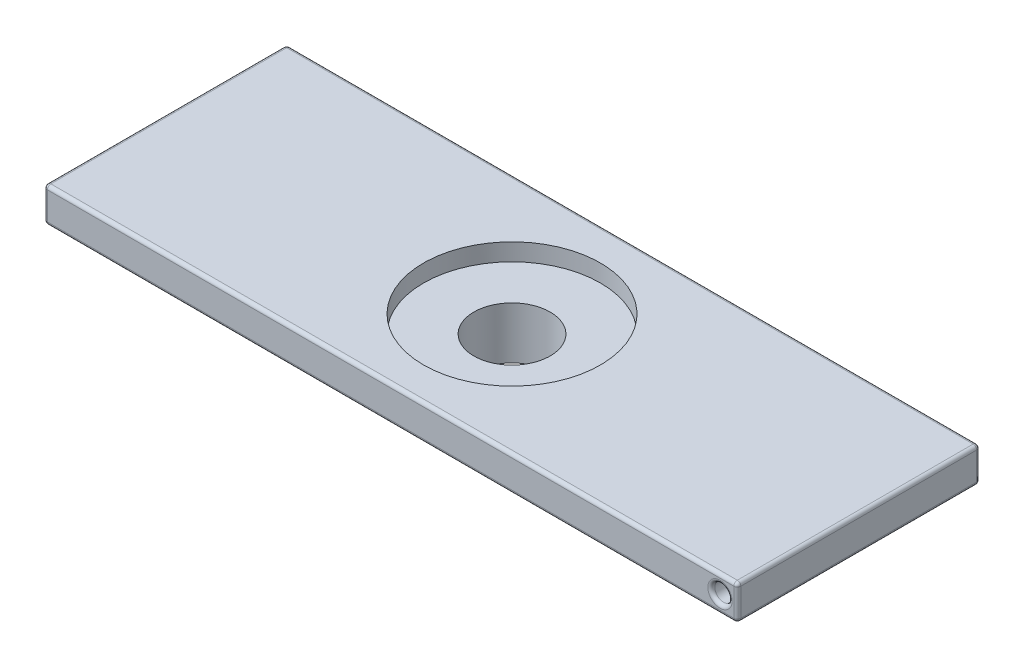
ISO-10303-21;
HEADER;
FILE_DESCRIPTION(('STEP AP214'),'2;1');
FILE_NAME('part.step','',(''),(''),'','','');
FILE_SCHEMA(('AUTOMOTIVE_DESIGN { 1 0 10303 214 1 1 1 1 }'));
ENDSEC;
DATA;
#1=APPLICATION_CONTEXT('core data for automotive mechanical design processes');
#2=APPLICATION_PROTOCOL_DEFINITION('international standard','automotive_design',2000,#1);
#3=PRODUCT_CONTEXT('',#1,'mechanical');
#4=PRODUCT('Part','Part','',(#3));
#5=PRODUCT_RELATED_PRODUCT_CATEGORY('part','',(#4));
#6=PRODUCT_DEFINITION_FORMATION('','',#4);
#7=PRODUCT_DEFINITION_CONTEXT('part definition',#1,'design');
#8=PRODUCT_DEFINITION('design','',#6,#7);
#9=PRODUCT_DEFINITION_SHAPE('','',#8);
#10=(LENGTH_UNIT() NAMED_UNIT(*) SI_UNIT(.MILLI.,.METRE.));
#11=(NAMED_UNIT(*) PLANE_ANGLE_UNIT() SI_UNIT($,.RADIAN.));
#12=(NAMED_UNIT(*) SI_UNIT($,.STERADIAN.) SOLID_ANGLE_UNIT());
#13=UNCERTAINTY_MEASURE_WITH_UNIT(LENGTH_MEASURE(1.E-05),#10,'distance_accuracy_value','');
#14=(GEOMETRIC_REPRESENTATION_CONTEXT(3) GLOBAL_UNCERTAINTY_ASSIGNED_CONTEXT((#13)) GLOBAL_UNIT_ASSIGNED_CONTEXT((#10,
#11,#12)) REPRESENTATION_CONTEXT('',''));
#15=CARTESIAN_POINT('',(0.,0.,0.));
#16=DIRECTION('',(0.,0.,1.));
#17=DIRECTION('',(1.,0.,0.));
#18=AXIS2_PLACEMENT_3D('',#15,#16,#17);
#19=CARTESIAN_POINT('',(0.,0.,0.));
#20=DIRECTION('',(0.,1.,0.));
#21=DIRECTION('',(0.,0.,1.));
#22=AXIS2_PLACEMENT_3D('',#19,#20,#21);
#23=PLANE('',#22);
#24=CARTESIAN_POINT('',(0.,0.,0.));
#25=DIRECTION('',(0.,1.,0.));
#26=DIRECTION('',(0.,0.,1.));
#27=AXIS2_PLACEMENT_3D('',#24,#25,#26);
#28=CIRCLE('',#27,12.);
#29=CARTESIAN_POINT('',(0.,0.,12.));
#30=VERTEX_POINT('',#29);
#31=EDGE_CURVE('E170',#30,#30,#28,.T.);
#32=ORIENTED_EDGE('',*,*,#31,.F.);
#33=EDGE_LOOP('',(#32));
#34=FACE_BOUND('',#33,.T.);
#35=CARTESIAN_POINT('',(0.,0.,0.));
#36=DIRECTION('',(0.,1.,0.));
#37=DIRECTION('',(0.,0.,1.));
#38=AXIS2_PLACEMENT_3D('',#35,#36,#37);
#39=CIRCLE('',#38,11.);
#40=CARTESIAN_POINT('',(0.,0.,11.));
#41=VERTEX_POINT('',#40);
#42=EDGE_CURVE('E301',#41,#41,#39,.T.);
#43=ORIENTED_EDGE('',*,*,#42,.T.);
#44=EDGE_LOOP('',(#43));
#45=FACE_BOUND('',#44,.T.);
#46=ADVANCED_FACE('F41',(#34,#45),#23,.F.);
#47=CARTESIAN_POINT('',(0.,10.,0.));
#48=DIRECTION('',(0.,-1.,0.));
#49=DIRECTION('',(0.,0.,-1.));
#50=AXIS2_PLACEMENT_3D('',#47,#48,#49);
#51=CYLINDRICAL_SURFACE('',#50,12.);
#52=CARTESIAN_POINT('',(0.,10.,0.));
#53=DIRECTION('',(0.,1.,0.));
#54=DIRECTION('',(0.,0.,1.));
#55=AXIS2_PLACEMENT_3D('',#52,#53,#54);
#56=CIRCLE('',#55,12.);
#57=CARTESIAN_POINT('',(0.,10.,12.));
#58=VERTEX_POINT('',#57);
#59=EDGE_CURVE('E167',#58,#58,#56,.T.);
#60=ORIENTED_EDGE('',*,*,#59,.F.);
#61=EDGE_LOOP('',(#60));
#62=FACE_BOUND('',#61,.T.);
#63=ORIENTED_EDGE('',*,*,#31,.T.);
#64=EDGE_LOOP('',(#63));
#65=FACE_BOUND('',#64,.T.);
#66=ADVANCED_FACE('F306',(#62,#65),#51,.T.);
#67=CARTESIAN_POINT('',(0.,10.,0.));
#68=DIRECTION('',(0.,-1.,0.));
#69=DIRECTION('',(0.,0.,-1.));
#70=AXIS2_PLACEMENT_3D('',#67,#68,#69);
#71=CYLINDRICAL_SURFACE('',#70,11.);
#72=CARTESIAN_POINT('',(0.,15.,0.));
#73=DIRECTION('',(0.,-1.,0.));
#74=DIRECTION('',(0.,0.,-1.));
#75=AXIS2_PLACEMENT_3D('',#72,#73,#74);
#76=CIRCLE('',#75,11.);
#77=CARTESIAN_POINT('',(0.,15.,-11.));
#78=VERTEX_POINT('',#77);
#79=EDGE_CURVE('E173',#78,#78,#76,.T.);
#80=ORIENTED_EDGE('',*,*,#79,.F.);
#81=EDGE_LOOP('',(#80));
#82=FACE_BOUND('',#81,.T.);
#83=ORIENTED_EDGE('',*,*,#42,.F.);
#84=EDGE_LOOP('',(#83));
#85=FACE_BOUND('',#84,.T.);
#86=ADVANCED_FACE('F313',(#82,#85),#71,.F.);
#87=CARTESIAN_POINT('',(100.,20.,35.));
#88=DIRECTION('',(-1.,0.,0.));
#89=DIRECTION('',(0.,0.,1.));
#90=AXIS2_PLACEMENT_3D('',#87,#88,#89);
#91=PLANE('',#90);
#92=DIRECTION('',(0.,0.,-1.));
#93=VECTOR('',#92,1.);
#94=CARTESIAN_POINT('',(100.,11.,-35.));
#95=LINE('',#94,#93);
#96=CARTESIAN_POINT('',(100.,11.,34.));
#97=VERTEX_POINT('',#96);
#98=CARTESIAN_POINT('',(100.,11.,-34.));
#99=VERTEX_POINT('',#98);
#100=EDGE_CURVE('E181',#97,#99,#95,.T.);
#101=ORIENTED_EDGE('',*,*,#100,.T.);
#102=DIRECTION('',(0.,-1.,0.));
#103=VECTOR('',#102,1.);
#104=CARTESIAN_POINT('',(100.,20.,-34.));
#105=LINE('',#104,#103);
#106=CARTESIAN_POINT('',(100.,19.,-34.));
#107=VERTEX_POINT('',#106);
#108=EDGE_CURVE('E186',#99,#107,#105,.F.);
#109=ORIENTED_EDGE('',*,*,#108,.T.);
#110=DIRECTION('',(0.,0.,-1.));
#111=VECTOR('',#110,1.);
#112=CARTESIAN_POINT('',(100.,19.,35.));
#113=LINE('',#112,#111);
#114=CARTESIAN_POINT('',(100.,19.,34.));
#115=VERTEX_POINT('',#114);
#116=EDGE_CURVE('E183',#107,#115,#113,.F.);
#117=ORIENTED_EDGE('',*,*,#116,.T.);
#118=DIRECTION('',(0.,-1.,0.));
#119=VECTOR('',#118,1.);
#120=CARTESIAN_POINT('',(100.,20.,34.));
#121=LINE('',#120,#119);
#122=EDGE_CURVE('E179',#115,#97,#121,.T.);
#123=ORIENTED_EDGE('',*,*,#122,.T.);
#124=EDGE_LOOP('',(#101,#109,#117,#123));
#125=FACE_BOUND('',#124,.T.);
#126=ADVANCED_FACE('F315',(#125),#91,.F.);
#127=CARTESIAN_POINT('',(-100.,20.,-35.));
#128=DIRECTION('',(0.,0.,1.));
#129=DIRECTION('',(1.,0.,0.));
#130=AXIS2_PLACEMENT_3D('',#127,#128,#129);
#131=PLANE('',#130);
#132=CARTESIAN_POINT('',(-95.,15.,-35.));
#133=DIRECTION('',(0.,0.,1.));
#134=DIRECTION('',(1.,0.,0.));
#135=AXIS2_PLACEMENT_3D('',#132,#133,#134);
#136=CIRCLE('',#135,3.5);
#137=CARTESIAN_POINT('',(-91.5,15.,-35.));
#138=VERTEX_POINT('',#137);
#139=EDGE_CURVE('E206',#138,#138,#136,.T.);
#140=ORIENTED_EDGE('',*,*,#139,.T.);
#141=EDGE_LOOP('',(#140));
#142=FACE_BOUND('',#141,.T.);
#143=DIRECTION('',(-1.,0.,0.));
#144=VECTOR('',#143,1.);
#145=CARTESIAN_POINT('',(-100.,19.,-35.));
#146=LINE('',#145,#144);
#147=CARTESIAN_POINT('',(-99.,19.,-35.));
#148=VERTEX_POINT('',#147);
#149=CARTESIAN_POINT('',(99.,19.,-35.));
#150=VERTEX_POINT('',#149);
#151=EDGE_CURVE('E201',#148,#150,#146,.F.);
#152=ORIENTED_EDGE('',*,*,#151,.T.);
#153=DIRECTION('',(0.,-1.,0.));
#154=VECTOR('',#153,1.);
#155=CARTESIAN_POINT('',(99.,20.,-35.));
#156=LINE('',#155,#154);
#157=CARTESIAN_POINT('',(99.,11.,-35.));
#158=VERTEX_POINT('',#157);
#159=EDGE_CURVE('E203',#150,#158,#156,.T.);
#160=ORIENTED_EDGE('',*,*,#159,.T.);
#161=DIRECTION('',(-1.,0.,0.));
#162=VECTOR('',#161,1.);
#163=CARTESIAN_POINT('',(-100.,11.,-35.));
#164=LINE('',#163,#162);
#165=CARTESIAN_POINT('',(-99.,11.,-35.));
#166=VERTEX_POINT('',#165);
#167=EDGE_CURVE('E199',#158,#166,#164,.T.);
#168=ORIENTED_EDGE('',*,*,#167,.T.);
#169=DIRECTION('',(0.,-1.,0.));
#170=VECTOR('',#169,1.);
#171=CARTESIAN_POINT('',(-99.,20.,-35.));
#172=LINE('',#171,#170);
#173=EDGE_CURVE('E197',#166,#148,#172,.F.);
#174=ORIENTED_EDGE('',*,*,#173,.T.);
#175=EDGE_LOOP('',(#152,#160,#168,#174));
#176=FACE_BOUND('',#175,.T.);
#177=ADVANCED_FACE('F322',(#142,#176),#131,.F.);
#178=CARTESIAN_POINT('',(-100.,20.,35.));
#179=DIRECTION('',(1.,0.,0.));
#180=DIRECTION('',(0.,0.,-1.));
#181=AXIS2_PLACEMENT_3D('',#178,#179,#180);
#182=PLANE('',#181);
#183=DIRECTION('',(0.,0.,1.));
#184=VECTOR('',#183,1.);
#185=CARTESIAN_POINT('',(-100.,19.,35.));
#186=LINE('',#185,#184);
#187=CARTESIAN_POINT('',(-100.,19.,34.));
#188=VERTEX_POINT('',#187);
#189=CARTESIAN_POINT('',(-100.,19.,-34.));
#190=VERTEX_POINT('',#189);
#191=EDGE_CURVE('E149',#188,#190,#186,.F.);
#192=ORIENTED_EDGE('',*,*,#191,.T.);
#193=DIRECTION('',(0.,-1.,0.));
#194=VECTOR('',#193,1.);
#195=CARTESIAN_POINT('',(-100.,20.,-34.));
#196=LINE('',#195,#194);
#197=CARTESIAN_POINT('',(-100.,11.,-34.));
#198=VERTEX_POINT('',#197);
#199=EDGE_CURVE('E217',#190,#198,#196,.T.);
#200=ORIENTED_EDGE('',*,*,#199,.T.);
#201=DIRECTION('',(0.,0.,1.));
#202=VECTOR('',#201,1.);
#203=CARTESIAN_POINT('',(-100.,11.,35.));
#204=LINE('',#203,#202);
#205=CARTESIAN_POINT('',(-100.,11.,34.));
#206=VERTEX_POINT('',#205);
#207=EDGE_CURVE('E214',#198,#206,#204,.T.);
#208=ORIENTED_EDGE('',*,*,#207,.T.);
#209=DIRECTION('',(0.,-1.,0.));
#210=VECTOR('',#209,1.);
#211=CARTESIAN_POINT('',(-100.,20.,34.));
#212=LINE('',#211,#210);
#213=EDGE_CURVE('E212',#206,#188,#212,.F.);
#214=ORIENTED_EDGE('',*,*,#213,.T.);
#215=EDGE_LOOP('',(#192,#200,#208,#214));
#216=FACE_BOUND('',#215,.T.);
#217=ADVANCED_FACE('F447',(#216),#182,.F.);
#218=CARTESIAN_POINT('',(-100.,20.,35.));
#219=DIRECTION('',(0.,0.,-1.));
#220=DIRECTION('',(-1.,0.,0.));
#221=AXIS2_PLACEMENT_3D('',#218,#219,#220);
#222=PLANE('',#221);
#223=DIRECTION('',(1.,0.,0.));
#224=VECTOR('',#223,1.);
#225=CARTESIAN_POINT('',(-100.,19.,35.));
#226=LINE('',#225,#224);
#227=CARTESIAN_POINT('',(99.,19.,35.));
#228=VERTEX_POINT('',#227);
#229=CARTESIAN_POINT('',(-99.,19.,35.));
#230=VERTEX_POINT('',#229);
#231=EDGE_CURVE('E58',#228,#230,#226,.F.);
#232=ORIENTED_EDGE('',*,*,#231,.T.);
#233=DIRECTION('',(0.,-1.,0.));
#234=VECTOR('',#233,1.);
#235=CARTESIAN_POINT('',(-99.,20.,35.));
#236=LINE('',#235,#234);
#237=CARTESIAN_POINT('',(-99.,11.,35.));
#238=VERTEX_POINT('',#237);
#239=EDGE_CURVE('E50',#230,#238,#236,.T.);
#240=ORIENTED_EDGE('',*,*,#239,.T.);
#241=DIRECTION('',(1.,0.,0.));
#242=VECTOR('',#241,1.);
#243=CARTESIAN_POINT('',(100.,11.,35.));
#244=LINE('',#243,#242);
#245=CARTESIAN_POINT('',(99.,11.,35.));
#246=VERTEX_POINT('',#245);
#247=EDGE_CURVE('E223',#238,#246,#244,.T.);
#248=ORIENTED_EDGE('',*,*,#247,.T.);
#249=DIRECTION('',(0.,-1.,0.));
#250=VECTOR('',#249,1.);
#251=CARTESIAN_POINT('',(99.,20.,35.));
#252=LINE('',#251,#250);
#253=EDGE_CURVE('E63',#246,#228,#252,.F.);
#254=ORIENTED_EDGE('',*,*,#253,.T.);
#255=EDGE_LOOP('',(#232,#240,#248,#254));
#256=FACE_BOUND('',#255,.T.);
#257=CARTESIAN_POINT('',(95.,15.,35.));
#258=DIRECTION('',(0.,0.,-1.));
#259=DIRECTION('',(-1.,0.,0.));
#260=AXIS2_PLACEMENT_3D('',#257,#258,#259);
#261=CIRCLE('',#260,3.5);
#262=CARTESIAN_POINT('',(91.5,15.,35.));
#263=VERTEX_POINT('',#262);
#264=EDGE_CURVE('E220',#263,#263,#261,.T.);
#265=ORIENTED_EDGE('',*,*,#264,.T.);
#266=EDGE_LOOP('',(#265));
#267=FACE_BOUND('',#266,.T.);
#268=ADVANCED_FACE('F441',(#256,#267),#222,.F.);
#269=CARTESIAN_POINT('',(0.,20.,0.));
#270=DIRECTION('',(0.,-1.,0.));
#271=DIRECTION('',(0.,0.,-1.));
#272=AXIS2_PLACEMENT_3D('',#269,#270,#271);
#273=PLANE('',#272);
#274=DIRECTION('',(1.,0.,0.));
#275=VECTOR('',#274,1.);
#276=CARTESIAN_POINT('',(0.,20.,34.));
#277=LINE('',#276,#275);
#278=CARTESIAN_POINT('',(-99.,20.,34.));
#279=VERTEX_POINT('',#278);
#280=CARTESIAN_POINT('',(99.,20.,34.));
#281=VERTEX_POINT('',#280);
#282=EDGE_CURVE('E136',#279,#281,#277,.T.);
#283=ORIENTED_EDGE('',*,*,#282,.T.);
#284=DIRECTION('',(0.,0.,-1.));
#285=VECTOR('',#284,1.);
#286=CARTESIAN_POINT('',(99.,20.,0.));
#287=LINE('',#286,#285);
#288=CARTESIAN_POINT('',(99.,20.,-34.));
#289=VERTEX_POINT('',#288);
#290=EDGE_CURVE('E177',#281,#289,#287,.T.);
#291=ORIENTED_EDGE('',*,*,#290,.T.);
#292=DIRECTION('',(-1.,0.,0.));
#293=VECTOR('',#292,1.);
#294=CARTESIAN_POINT('',(0.,20.,-34.));
#295=LINE('',#294,#293);
#296=CARTESIAN_POINT('',(-99.,20.,-34.));
#297=VERTEX_POINT('',#296);
#298=EDGE_CURVE('E139',#289,#297,#295,.T.);
#299=ORIENTED_EDGE('',*,*,#298,.T.);
#300=DIRECTION('',(0.,0.,1.));
#301=VECTOR('',#300,1.);
#302=CARTESIAN_POINT('',(-99.,20.,0.));
#303=LINE('',#302,#301);
#304=EDGE_CURVE('E130',#297,#279,#303,.T.);
#305=ORIENTED_EDGE('',*,*,#304,.T.);
#306=EDGE_LOOP('',(#283,#291,#299,#305));
#307=FACE_BOUND('',#306,.T.);
#308=CARTESIAN_POINT('',(0.,20.,0.));
#309=DIRECTION('',(0.,1.,0.));
#310=DIRECTION('',(0.,0.,1.));
#311=AXIS2_PLACEMENT_3D('',#308,#309,#310);
#312=CIRCLE('',#311,25.5);
#313=CARTESIAN_POINT('',(0.,20.,25.5));
#314=VERTEX_POINT('',#313);
#315=EDGE_CURVE('E293',#314,#314,#312,.T.);
#316=ORIENTED_EDGE('',*,*,#315,.F.);
#317=EDGE_LOOP('',(#316));
#318=FACE_BOUND('',#317,.T.);
#319=ADVANCED_FACE('F132',(#307,#318),#273,.F.);
#320=CARTESIAN_POINT('',(0.,10.,0.));
#321=DIRECTION('',(0.,-1.,0.));
#322=DIRECTION('',(0.,0.,-1.));
#323=AXIS2_PLACEMENT_3D('',#320,#321,#322);
#324=PLANE('',#323);
#325=DIRECTION('',(-1.,0.,0.));
#326=VECTOR('',#325,1.);
#327=CARTESIAN_POINT('',(100.,10.,-34.));
#328=LINE('',#327,#326);
#329=CARTESIAN_POINT('',(-99.,10.,-34.));
#330=VERTEX_POINT('',#329);
#331=CARTESIAN_POINT('',(99.,10.,-34.));
#332=VERTEX_POINT('',#331);
#333=EDGE_CURVE('E192',#330,#332,#328,.F.);
#334=ORIENTED_EDGE('',*,*,#333,.T.);
#335=DIRECTION('',(0.,0.,-1.));
#336=VECTOR('',#335,1.);
#337=CARTESIAN_POINT('',(99.,10.,35.));
#338=LINE('',#337,#336);
#339=CARTESIAN_POINT('',(99.,10.,34.));
#340=VERTEX_POINT('',#339);
#341=EDGE_CURVE('E194',#332,#340,#338,.F.);
#342=ORIENTED_EDGE('',*,*,#341,.T.);
#343=DIRECTION('',(1.,0.,0.));
#344=VECTOR('',#343,1.);
#345=CARTESIAN_POINT('',(-100.,10.,34.));
#346=LINE('',#345,#344);
#347=CARTESIAN_POINT('',(-99.,10.,34.));
#348=VERTEX_POINT('',#347);
#349=EDGE_CURVE('E188',#340,#348,#346,.F.);
#350=ORIENTED_EDGE('',*,*,#349,.T.);
#351=DIRECTION('',(0.,0.,1.));
#352=VECTOR('',#351,1.);
#353=CARTESIAN_POINT('',(-99.,10.,-35.));
#354=LINE('',#353,#352);
#355=EDGE_CURVE('E190',#348,#330,#354,.F.);
#356=ORIENTED_EDGE('',*,*,#355,.T.);
#357=EDGE_LOOP('',(#334,#342,#350,#356));
#358=FACE_BOUND('',#357,.T.);
#359=ORIENTED_EDGE('',*,*,#59,.T.);
#360=EDGE_LOOP('',(#359));
#361=FACE_BOUND('',#360,.T.);
#362=ADVANCED_FACE('F437',(#358,#361),#324,.T.);
#363=CARTESIAN_POINT('',(0.,15.,0.));
#364=DIRECTION('',(0.,-1.,0.));
#365=DIRECTION('',(0.,0.,-1.));
#366=AXIS2_PLACEMENT_3D('',#363,#364,#365);
#367=PLANE('',#366);
#368=ORIENTED_EDGE('',*,*,#79,.T.);
#369=EDGE_LOOP('',(#368));
#370=FACE_BOUND('',#369,.T.);
#371=CARTESIAN_POINT('',(0.,15.,0.));
#372=DIRECTION('',(0.,-1.,0.));
#373=DIRECTION('',(0.,0.,-1.));
#374=AXIS2_PLACEMENT_3D('',#371,#372,#373);
#375=CIRCLE('',#374,25.5);
#376=CARTESIAN_POINT('',(0.,15.,-25.5));
#377=VERTEX_POINT('',#376);
#378=EDGE_CURVE('E298',#377,#377,#375,.F.);
#379=ORIENTED_EDGE('',*,*,#378,.T.);
#380=EDGE_LOOP('',(#379));
#381=FACE_BOUND('',#380,.T.);
#382=ADVANCED_FACE('F433',(#370,#381),#367,.F.);
#383=CARTESIAN_POINT('',(0.,-62.1248916810278,0.));
#384=DIRECTION('',(0.,1.,0.));
#385=DIRECTION('',(0.,0.,1.));
#386=AXIS2_PLACEMENT_3D('',#383,#384,#385);
#387=CYLINDRICAL_SURFACE('',#386,25.5);
#388=ORIENTED_EDGE('',*,*,#315,.T.);
#389=EDGE_LOOP('',(#388));
#390=FACE_BOUND('',#389,.T.);
#391=ORIENTED_EDGE('',*,*,#378,.F.);
#392=EDGE_LOOP('',(#391));
#393=FACE_BOUND('',#392,.T.);
#394=ADVANCED_FACE('F429',(#390,#393),#387,.F.);
#395=CARTESIAN_POINT('',(95.,15.,-5.));
#396=DIRECTION('',(0.,0.,1.));
#397=DIRECTION('',(1.,0.,0.));
#398=AXIS2_PLACEMENT_3D('',#395,#396,#397);
#399=CYLINDRICAL_SURFACE('',#398,2.5);
#400=CARTESIAN_POINT('',(95.,15.,34.));
#401=DIRECTION('',(0.,0.,-1.));
#402=DIRECTION('',(-1.,0.,0.));
#403=AXIS2_PLACEMENT_3D('',#400,#401,#402);
#404=CIRCLE('',#403,2.5);
#405=CARTESIAN_POINT('',(92.5,15.,34.));
#406=VERTEX_POINT('',#405);
#407=EDGE_CURVE('E12',#406,#406,#404,.F.);
#408=ORIENTED_EDGE('',*,*,#407,.T.);
#409=EDGE_LOOP('',(#408));
#410=FACE_BOUND('',#409,.T.);
#411=CARTESIAN_POINT('',(95.,15.,-5.));
#412=DIRECTION('',(0.,0.,1.));
#413=DIRECTION('',(1.,0.,0.));
#414=AXIS2_PLACEMENT_3D('',#411,#412,#413);
#415=CIRCLE('',#414,2.5);
#416=CARTESIAN_POINT('',(97.5,15.,-5.));
#417=VERTEX_POINT('',#416);
#418=EDGE_CURVE('E288',#417,#417,#415,.T.);
#419=ORIENTED_EDGE('',*,*,#418,.F.);
#420=EDGE_LOOP('',(#419));
#421=FACE_BOUND('',#420,.T.);
#422=ADVANCED_FACE('F423',(#410,#421),#399,.F.);
#423=CARTESIAN_POINT('',(95.,15.,-5.));
#424=DIRECTION('',(0.,0.,1.));
#425=DIRECTION('',(1.,0.,0.));
#426=AXIS2_PLACEMENT_3D('',#423,#424,#425);
#427=PLANE('',#426);
#428=ORIENTED_EDGE('',*,*,#418,.T.);
#429=EDGE_LOOP('',(#428));
#430=FACE_BOUND('',#429,.T.);
#431=ADVANCED_FACE('F416',(#430),#427,.T.);
#432=CARTESIAN_POINT('',(-95.,15.,5.));
#433=DIRECTION('',(0.,0.,-1.));
#434=DIRECTION('',(-1.,0.,0.));
#435=AXIS2_PLACEMENT_3D('',#432,#433,#434);
#436=CYLINDRICAL_SURFACE('',#435,2.5);
#437=CARTESIAN_POINT('',(-95.,15.,-34.));
#438=DIRECTION('',(0.,0.,1.));
#439=DIRECTION('',(1.,0.,0.));
#440=AXIS2_PLACEMENT_3D('',#437,#438,#439);
#441=CIRCLE('',#440,2.5);
#442=CARTESIAN_POINT('',(-92.5,15.,-34.));
#443=VERTEX_POINT('',#442);
#444=EDGE_CURVE('E209',#443,#443,#441,.F.);
#445=ORIENTED_EDGE('',*,*,#444,.T.);
#446=EDGE_LOOP('',(#445));
#447=FACE_BOUND('',#446,.T.);
#448=CARTESIAN_POINT('',(-95.,15.,5.));
#449=DIRECTION('',(0.,0.,-1.));
#450=DIRECTION('',(-1.,0.,0.));
#451=AXIS2_PLACEMENT_3D('',#448,#449,#450);
#452=CIRCLE('',#451,2.5);
#453=CARTESIAN_POINT('',(-97.5,15.,5.));
#454=VERTEX_POINT('',#453);
#455=EDGE_CURVE('E282',#454,#454,#452,.T.);
#456=ORIENTED_EDGE('',*,*,#455,.F.);
#457=EDGE_LOOP('',(#456));
#458=FACE_BOUND('',#457,.T.);
#459=ADVANCED_FACE('F413',(#447,#458),#436,.F.);
#460=CARTESIAN_POINT('',(-95.,15.,5.));
#461=DIRECTION('',(0.,0.,-1.));
#462=DIRECTION('',(-1.,0.,0.));
#463=AXIS2_PLACEMENT_3D('',#460,#461,#462);
#464=PLANE('',#463);
#465=ORIENTED_EDGE('',*,*,#455,.T.);
#466=EDGE_LOOP('',(#465));
#467=FACE_BOUND('',#466,.T.);
#468=ADVANCED_FACE('F401',(#467),#464,.T.);
#469=CARTESIAN_POINT('',(-99.,11.,35.));
#470=DIRECTION('',(0.,0.,-1.));
#471=DIRECTION('',(-1.,0.,0.));
#472=AXIS2_PLACEMENT_3D('',#469,#470,#471);
#473=CYLINDRICAL_SURFACE('',#472,1.);
#474=CARTESIAN_POINT('',(-99.,11.,34.));
#475=DIRECTION('',(0.,0.,1.));
#476=DIRECTION('',(1.,0.,0.));
#477=AXIS2_PLACEMENT_3D('',#474,#475,#476);
#478=CIRCLE('',#477,1.);
#479=EDGE_CURVE('E45',#206,#348,#478,.T.);
#480=ORIENTED_EDGE('',*,*,#479,.F.);
#481=ORIENTED_EDGE('',*,*,#207,.F.);
#482=CARTESIAN_POINT('',(-99.,11.,-34.));
#483=DIRECTION('',(0.,0.,-1.));
#484=DIRECTION('',(-1.,0.,0.));
#485=AXIS2_PLACEMENT_3D('',#482,#483,#484);
#486=CIRCLE('',#485,1.);
#487=EDGE_CURVE('E274',#330,#198,#486,.T.);
#488=ORIENTED_EDGE('',*,*,#487,.F.);
#489=ORIENTED_EDGE('',*,*,#355,.F.);
#490=EDGE_LOOP('',(#480,#481,#488,#489));
#491=FACE_BOUND('',#490,.T.);
#492=ADVANCED_FACE('F399',(#491),#473,.T.);
#493=CARTESIAN_POINT('',(-99.,11.,34.));
#494=DIRECTION('',(0.,-1.,0.));
#495=DIRECTION('',(0.,0.,-1.));
#496=AXIS2_PLACEMENT_3D('',#493,#494,#495);
#497=SPHERICAL_SURFACE('',#496,1.);
#498=CARTESIAN_POINT('',(-99.,11.,34.));
#499=DIRECTION('',(0.,-1.,0.));
#500=DIRECTION('',(0.,0.,-1.));
#501=AXIS2_PLACEMENT_3D('',#498,#499,#500);
#502=CIRCLE('',#501,1.);
#503=EDGE_CURVE('E269',#206,#238,#502,.F.);
#504=ORIENTED_EDGE('',*,*,#503,.F.);
#505=ORIENTED_EDGE('',*,*,#479,.T.);
#506=CARTESIAN_POINT('',(-99.,11.,34.));
#507=DIRECTION('',(-1.,0.,0.));
#508=DIRECTION('',(0.,0.,1.));
#509=AXIS2_PLACEMENT_3D('',#506,#507,#508);
#510=CIRCLE('',#509,1.);
#511=EDGE_CURVE('E272',#238,#348,#510,.F.);
#512=ORIENTED_EDGE('',*,*,#511,.F.);
#513=EDGE_LOOP('',(#504,#505,#512));
#514=FACE_BOUND('',#513,.T.);
#515=ADVANCED_FACE('F396',(#514),#497,.T.);
#516=CARTESIAN_POINT('',(-99.,11.,-34.));
#517=DIRECTION('',(-1.,0.,0.));
#518=DIRECTION('',(0.,0.,1.));
#519=AXIS2_PLACEMENT_3D('',#516,#517,#518);
#520=SPHERICAL_SURFACE('',#519,1.);
#521=CARTESIAN_POINT('',(-99.,11.,-34.));
#522=DIRECTION('',(-1.,0.,0.));
#523=DIRECTION('',(0.,0.,1.));
#524=AXIS2_PLACEMENT_3D('',#521,#522,#523);
#525=CIRCLE('',#524,1.);
#526=EDGE_CURVE('E264',#330,#166,#525,.F.);
#527=ORIENTED_EDGE('',*,*,#526,.F.);
#528=ORIENTED_EDGE('',*,*,#487,.T.);
#529=CARTESIAN_POINT('',(-99.,11.,-34.));
#530=DIRECTION('',(0.,-1.,0.));
#531=DIRECTION('',(0.,0.,-1.));
#532=AXIS2_PLACEMENT_3D('',#529,#530,#531);
#533=CIRCLE('',#532,1.);
#534=EDGE_CURVE('E267',#166,#198,#533,.F.);
#535=ORIENTED_EDGE('',*,*,#534,.F.);
#536=EDGE_LOOP('',(#527,#528,#535));
#537=FACE_BOUND('',#536,.T.);
#538=ADVANCED_FACE('F392',(#537),#520,.T.);
#539=CARTESIAN_POINT('',(-100.,11.,34.));
#540=DIRECTION('',(-1.,0.,0.));
#541=DIRECTION('',(0.,0.,1.));
#542=AXIS2_PLACEMENT_3D('',#539,#540,#541);
#543=CYLINDRICAL_SURFACE('',#542,1.);
#544=ORIENTED_EDGE('',*,*,#511,.T.);
#545=ORIENTED_EDGE('',*,*,#349,.F.);
#546=CARTESIAN_POINT('',(99.,11.,34.));
#547=DIRECTION('',(1.,0.,0.));
#548=DIRECTION('',(0.,0.,-1.));
#549=AXIS2_PLACEMENT_3D('',#546,#547,#548);
#550=CIRCLE('',#549,1.);
#551=EDGE_CURVE('E259',#246,#340,#550,.T.);
#552=ORIENTED_EDGE('',*,*,#551,.F.);
#553=ORIENTED_EDGE('',*,*,#247,.F.);
#554=EDGE_LOOP('',(#544,#545,#552,#553));
#555=FACE_BOUND('',#554,.T.);
#556=ADVANCED_FACE('F388',(#555),#543,.T.);
#557=CARTESIAN_POINT('',(-99.,20.,34.));
#558=DIRECTION('',(0.,-1.,0.));
#559=DIRECTION('',(0.,0.,-1.));
#560=AXIS2_PLACEMENT_3D('',#557,#558,#559);
#561=CYLINDRICAL_SURFACE('',#560,1.);
#562=ORIENTED_EDGE('',*,*,#503,.T.);
#563=ORIENTED_EDGE('',*,*,#239,.F.);
#564=CARTESIAN_POINT('',(-99.,19.,34.));
#565=DIRECTION('',(0.,1.,0.));
#566=DIRECTION('',(0.,0.,1.));
#567=AXIS2_PLACEMENT_3D('',#564,#565,#566);
#568=CIRCLE('',#567,1.);
#569=EDGE_CURVE('E153',#188,#230,#568,.T.);
#570=ORIENTED_EDGE('',*,*,#569,.F.);
#571=ORIENTED_EDGE('',*,*,#213,.F.);
#572=EDGE_LOOP('',(#562,#563,#570,#571));
#573=FACE_BOUND('',#572,.T.);
#574=ADVANCED_FACE('F385',(#573),#561,.T.);
#575=CARTESIAN_POINT('',(-99.,19.,0.));
#576=DIRECTION('',(0.,0.,1.));
#577=DIRECTION('',(1.,0.,0.));
#578=AXIS2_PLACEMENT_3D('',#575,#576,#577);
#579=CYLINDRICAL_SURFACE('',#578,1.);
#580=CARTESIAN_POINT('',(-99.,19.,-34.));
#581=DIRECTION('',(0.,0.,-1.));
#582=DIRECTION('',(-1.,0.,0.));
#583=AXIS2_PLACEMENT_3D('',#580,#581,#582);
#584=CIRCLE('',#583,1.);
#585=EDGE_CURVE('E154',#190,#297,#584,.T.);
#586=ORIENTED_EDGE('',*,*,#585,.F.);
#587=ORIENTED_EDGE('',*,*,#191,.F.);
#588=CARTESIAN_POINT('',(-99.,19.,34.));
#589=DIRECTION('',(0.,0.,1.));
#590=DIRECTION('',(1.,0.,0.));
#591=AXIS2_PLACEMENT_3D('',#588,#589,#590);
#592=CIRCLE('',#591,1.);
#593=EDGE_CURVE('E146',#279,#188,#592,.T.);
#594=ORIENTED_EDGE('',*,*,#593,.F.);
#595=ORIENTED_EDGE('',*,*,#304,.F.);
#596=EDGE_LOOP('',(#586,#587,#594,#595));
#597=FACE_BOUND('',#596,.T.);
#598=ADVANCED_FACE('F148',(#597),#579,.T.);
#599=CARTESIAN_POINT('',(-99.,20.,-34.));
#600=DIRECTION('',(0.,-1.,0.));
#601=DIRECTION('',(0.,0.,-1.));
#602=AXIS2_PLACEMENT_3D('',#599,#600,#601);
#603=CYLINDRICAL_SURFACE('',#602,1.);
#604=ORIENTED_EDGE('',*,*,#534,.T.);
#605=ORIENTED_EDGE('',*,*,#199,.F.);
#606=CARTESIAN_POINT('',(-99.,19.,-34.));
#607=DIRECTION('',(0.,1.,0.));
#608=DIRECTION('',(0.,0.,1.));
#609=AXIS2_PLACEMENT_3D('',#606,#607,#608);
#610=CIRCLE('',#609,1.);
#611=EDGE_CURVE('E254',#148,#190,#610,.T.);
#612=ORIENTED_EDGE('',*,*,#611,.F.);
#613=ORIENTED_EDGE('',*,*,#173,.F.);
#614=EDGE_LOOP('',(#604,#605,#612,#613));
#615=FACE_BOUND('',#614,.T.);
#616=ADVANCED_FACE('F378',(#615),#603,.T.);
#617=CARTESIAN_POINT('',(-100.,11.,-34.));
#618=DIRECTION('',(1.,0.,0.));
#619=DIRECTION('',(0.,0.,-1.));
#620=AXIS2_PLACEMENT_3D('',#617,#618,#619);
#621=CYLINDRICAL_SURFACE('',#620,1.);
#622=ORIENTED_EDGE('',*,*,#526,.T.);
#623=ORIENTED_EDGE('',*,*,#167,.F.);
#624=CARTESIAN_POINT('',(99.,11.,-34.));
#625=DIRECTION('',(1.,0.,0.));
#626=DIRECTION('',(0.,0.,-1.));
#627=AXIS2_PLACEMENT_3D('',#624,#625,#626);
#628=CIRCLE('',#627,1.);
#629=EDGE_CURVE('E251',#332,#158,#628,.T.);
#630=ORIENTED_EDGE('',*,*,#629,.F.);
#631=ORIENTED_EDGE('',*,*,#333,.F.);
#632=EDGE_LOOP('',(#622,#623,#630,#631));
#633=FACE_BOUND('',#632,.T.);
#634=ADVANCED_FACE('F374',(#633),#621,.T.);
#635=CARTESIAN_POINT('',(99.,11.,35.));
#636=DIRECTION('',(0.,0.,1.));
#637=DIRECTION('',(1.,0.,0.));
#638=AXIS2_PLACEMENT_3D('',#635,#636,#637);
#639=CYLINDRICAL_SURFACE('',#638,1.);
#640=CARTESIAN_POINT('',(99.,11.,34.));
#641=DIRECTION('',(0.,0.,1.));
#642=DIRECTION('',(1.,0.,0.));
#643=AXIS2_PLACEMENT_3D('',#640,#641,#642);
#644=CIRCLE('',#643,1.);
#645=EDGE_CURVE('E261',#340,#97,#644,.T.);
#646=ORIENTED_EDGE('',*,*,#645,.F.);
#647=ORIENTED_EDGE('',*,*,#341,.F.);
#648=CARTESIAN_POINT('',(99.,11.,-34.));
#649=DIRECTION('',(0.,0.,-1.));
#650=DIRECTION('',(-1.,0.,0.));
#651=AXIS2_PLACEMENT_3D('',#648,#649,#650);
#652=CIRCLE('',#651,1.);
#653=EDGE_CURVE('E248',#99,#332,#652,.T.);
#654=ORIENTED_EDGE('',*,*,#653,.F.);
#655=ORIENTED_EDGE('',*,*,#100,.F.);
#656=EDGE_LOOP('',(#646,#647,#654,#655));
#657=FACE_BOUND('',#656,.T.);
#658=ADVANCED_FACE('F370',(#657),#639,.T.);
#659=CARTESIAN_POINT('',(99.,11.,34.));
#660=DIRECTION('',(0.,-1.,0.));
#661=DIRECTION('',(0.,0.,-1.));
#662=AXIS2_PLACEMENT_3D('',#659,#660,#661);
#663=SPHERICAL_SURFACE('',#662,1.);
#664=ORIENTED_EDGE('',*,*,#551,.T.);
#665=ORIENTED_EDGE('',*,*,#645,.T.);
#666=CARTESIAN_POINT('',(99.,11.,34.));
#667=DIRECTION('',(0.,-1.,0.));
#668=DIRECTION('',(0.,0.,-1.));
#669=AXIS2_PLACEMENT_3D('',#666,#667,#668);
#670=CIRCLE('',#669,1.);
#671=EDGE_CURVE('E160',#246,#97,#670,.F.);
#672=ORIENTED_EDGE('',*,*,#671,.F.);
#673=EDGE_LOOP('',(#664,#665,#672));
#674=FACE_BOUND('',#673,.T.);
#675=ADVANCED_FACE('F367',(#674),#663,.T.);
#676=CARTESIAN_POINT('',(-99.,19.,34.));
#677=DIRECTION('',(-1.,0.,0.));
#678=DIRECTION('',(0.,0.,1.));
#679=AXIS2_PLACEMENT_3D('',#676,#677,#678);
#680=SPHERICAL_SURFACE('',#679,1.);
#681=ORIENTED_EDGE('',*,*,#593,.T.);
#682=ORIENTED_EDGE('',*,*,#569,.T.);
#683=CARTESIAN_POINT('',(-99.,19.,34.));
#684=DIRECTION('',(-1.,0.,0.));
#685=DIRECTION('',(0.,0.,1.));
#686=AXIS2_PLACEMENT_3D('',#683,#684,#685);
#687=CIRCLE('',#686,1.);
#688=EDGE_CURVE('E157',#279,#230,#687,.F.);
#689=ORIENTED_EDGE('',*,*,#688,.F.);
#690=EDGE_LOOP('',(#681,#682,#689));
#691=FACE_BOUND('',#690,.T.);
#692=ADVANCED_FACE('F158',(#691),#680,.T.);
#693=CARTESIAN_POINT('',(-99.,19.,-34.));
#694=DIRECTION('',(-1.,0.,0.));
#695=DIRECTION('',(0.,0.,1.));
#696=AXIS2_PLACEMENT_3D('',#693,#694,#695);
#697=SPHERICAL_SURFACE('',#696,1.);
#698=ORIENTED_EDGE('',*,*,#611,.T.);
#699=ORIENTED_EDGE('',*,*,#585,.T.);
#700=CARTESIAN_POINT('',(-99.,19.,-34.));
#701=DIRECTION('',(-1.,0.,0.));
#702=DIRECTION('',(0.,0.,1.));
#703=AXIS2_PLACEMENT_3D('',#700,#701,#702);
#704=CIRCLE('',#703,1.);
#705=EDGE_CURVE('E161',#148,#297,#704,.F.);
#706=ORIENTED_EDGE('',*,*,#705,.F.);
#707=EDGE_LOOP('',(#698,#699,#706));
#708=FACE_BOUND('',#707,.T.);
#709=ADVANCED_FACE('F360',(#708),#697,.T.);
#710=CARTESIAN_POINT('',(99.,11.,-34.));
#711=DIRECTION('',(0.,-1.,0.));
#712=DIRECTION('',(0.,0.,-1.));
#713=AXIS2_PLACEMENT_3D('',#710,#711,#712);
#714=SPHERICAL_SURFACE('',#713,1.);
#715=ORIENTED_EDGE('',*,*,#653,.T.);
#716=ORIENTED_EDGE('',*,*,#629,.T.);
#717=CARTESIAN_POINT('',(99.,11.,-34.));
#718=DIRECTION('',(0.,-1.,0.));
#719=DIRECTION('',(0.,0.,-1.));
#720=AXIS2_PLACEMENT_3D('',#717,#718,#719);
#721=CIRCLE('',#720,1.);
#722=EDGE_CURVE('E242',#99,#158,#721,.F.);
#723=ORIENTED_EDGE('',*,*,#722,.F.);
#724=EDGE_LOOP('',(#715,#716,#723));
#725=FACE_BOUND('',#724,.T.);
#726=ADVANCED_FACE('F356',(#725),#714,.T.);
#727=CARTESIAN_POINT('',(99.,20.,34.));
#728=DIRECTION('',(0.,-1.,0.));
#729=DIRECTION('',(0.,0.,-1.));
#730=AXIS2_PLACEMENT_3D('',#727,#728,#729);
#731=CYLINDRICAL_SURFACE('',#730,1.);
#732=ORIENTED_EDGE('',*,*,#671,.T.);
#733=ORIENTED_EDGE('',*,*,#122,.F.);
#734=CARTESIAN_POINT('',(99.,19.,34.));
#735=DIRECTION('',(0.,1.,0.));
#736=DIRECTION('',(0.,0.,1.));
#737=AXIS2_PLACEMENT_3D('',#734,#735,#736);
#738=CIRCLE('',#737,1.);
#739=EDGE_CURVE('E239',#228,#115,#738,.T.);
#740=ORIENTED_EDGE('',*,*,#739,.F.);
#741=ORIENTED_EDGE('',*,*,#253,.F.);
#742=EDGE_LOOP('',(#732,#733,#740,#741));
#743=FACE_BOUND('',#742,.T.);
#744=ADVANCED_FACE('F353',(#743),#731,.T.);
#745=CARTESIAN_POINT('',(0.,19.,34.));
#746=DIRECTION('',(1.,0.,0.));
#747=DIRECTION('',(0.,0.,-1.));
#748=AXIS2_PLACEMENT_3D('',#745,#746,#747);
#749=CYLINDRICAL_SURFACE('',#748,1.);
#750=ORIENTED_EDGE('',*,*,#688,.T.);
#751=ORIENTED_EDGE('',*,*,#231,.F.);
#752=CARTESIAN_POINT('',(99.,19.,34.));
#753=DIRECTION('',(1.,0.,0.));
#754=DIRECTION('',(0.,0.,-1.));
#755=AXIS2_PLACEMENT_3D('',#752,#753,#754);
#756=CIRCLE('',#755,1.);
#757=EDGE_CURVE('E165',#281,#228,#756,.T.);
#758=ORIENTED_EDGE('',*,*,#757,.F.);
#759=ORIENTED_EDGE('',*,*,#282,.F.);
#760=EDGE_LOOP('',(#750,#751,#758,#759));
#761=FACE_BOUND('',#760,.T.);
#762=ADVANCED_FACE('F163',(#761),#749,.T.);
#763=CARTESIAN_POINT('',(0.,19.,-34.));
#764=DIRECTION('',(-1.,0.,0.));
#765=DIRECTION('',(0.,0.,1.));
#766=AXIS2_PLACEMENT_3D('',#763,#764,#765);
#767=CYLINDRICAL_SURFACE('',#766,1.);
#768=ORIENTED_EDGE('',*,*,#705,.T.);
#769=ORIENTED_EDGE('',*,*,#298,.F.);
#770=CARTESIAN_POINT('',(99.,19.,-34.));
#771=DIRECTION('',(1.,0.,0.));
#772=DIRECTION('',(0.,0.,-1.));
#773=AXIS2_PLACEMENT_3D('',#770,#771,#772);
#774=CIRCLE('',#773,1.);
#775=EDGE_CURVE('E235',#150,#289,#774,.T.);
#776=ORIENTED_EDGE('',*,*,#775,.F.);
#777=ORIENTED_EDGE('',*,*,#151,.F.);
#778=EDGE_LOOP('',(#768,#769,#776,#777));
#779=FACE_BOUND('',#778,.T.);
#780=ADVANCED_FACE('F346',(#779),#767,.T.);
#781=CARTESIAN_POINT('',(99.,20.,-34.));
#782=DIRECTION('',(0.,-1.,0.));
#783=DIRECTION('',(0.,0.,-1.));
#784=AXIS2_PLACEMENT_3D('',#781,#782,#783);
#785=CYLINDRICAL_SURFACE('',#784,1.);
#786=ORIENTED_EDGE('',*,*,#722,.T.);
#787=ORIENTED_EDGE('',*,*,#159,.F.);
#788=CARTESIAN_POINT('',(99.,19.,-34.));
#789=DIRECTION('',(0.,1.,0.));
#790=DIRECTION('',(0.,0.,1.));
#791=AXIS2_PLACEMENT_3D('',#788,#789,#790);
#792=CIRCLE('',#791,1.);
#793=EDGE_CURVE('E232',#107,#150,#792,.T.);
#794=ORIENTED_EDGE('',*,*,#793,.F.);
#795=ORIENTED_EDGE('',*,*,#108,.F.);
#796=EDGE_LOOP('',(#786,#787,#794,#795));
#797=FACE_BOUND('',#796,.T.);
#798=ADVANCED_FACE('F342',(#797),#785,.T.);
#799=CARTESIAN_POINT('',(99.,19.,34.));
#800=DIRECTION('',(0.,0.,1.));
#801=DIRECTION('',(1.,0.,0.));
#802=AXIS2_PLACEMENT_3D('',#799,#800,#801);
#803=SPHERICAL_SURFACE('',#802,1.);
#804=ORIENTED_EDGE('',*,*,#757,.T.);
#805=ORIENTED_EDGE('',*,*,#739,.T.);
#806=CARTESIAN_POINT('',(99.,19.,34.));
#807=DIRECTION('',(0.,0.,1.));
#808=DIRECTION('',(1.,0.,0.));
#809=AXIS2_PLACEMENT_3D('',#806,#807,#808);
#810=CIRCLE('',#809,1.);
#811=EDGE_CURVE('E230',#281,#115,#810,.F.);
#812=ORIENTED_EDGE('',*,*,#811,.F.);
#813=EDGE_LOOP('',(#804,#805,#812));
#814=FACE_BOUND('',#813,.T.);
#815=ADVANCED_FACE('F338',(#814),#803,.T.);
#816=CARTESIAN_POINT('',(99.,19.,-34.));
#817=DIRECTION('',(0.,0.,-1.));
#818=DIRECTION('',(-1.,0.,0.));
#819=AXIS2_PLACEMENT_3D('',#816,#817,#818);
#820=SPHERICAL_SURFACE('',#819,1.);
#821=ORIENTED_EDGE('',*,*,#793,.T.);
#822=ORIENTED_EDGE('',*,*,#775,.T.);
#823=CARTESIAN_POINT('',(99.,19.,-34.));
#824=DIRECTION('',(0.,0.,-1.));
#825=DIRECTION('',(-1.,0.,0.));
#826=AXIS2_PLACEMENT_3D('',#823,#824,#825);
#827=CIRCLE('',#826,1.);
#828=EDGE_CURVE('E228',#107,#289,#827,.F.);
#829=ORIENTED_EDGE('',*,*,#828,.F.);
#830=EDGE_LOOP('',(#821,#822,#829));
#831=FACE_BOUND('',#830,.T.);
#832=ADVANCED_FACE('F334',(#831),#820,.T.);
#833=CARTESIAN_POINT('',(99.,19.,0.));
#834=DIRECTION('',(0.,0.,-1.));
#835=DIRECTION('',(-1.,0.,0.));
#836=AXIS2_PLACEMENT_3D('',#833,#834,#835);
#837=CYLINDRICAL_SURFACE('',#836,1.);
#838=ORIENTED_EDGE('',*,*,#811,.T.);
#839=ORIENTED_EDGE('',*,*,#116,.F.);
#840=ORIENTED_EDGE('',*,*,#828,.T.);
#841=ORIENTED_EDGE('',*,*,#290,.F.);
#842=EDGE_LOOP('',(#838,#839,#840,#841));
#843=FACE_BOUND('',#842,.T.);
#844=ADVANCED_FACE('F330',(#843),#837,.T.);
#845=CARTESIAN_POINT('',(-95.,15.,-34.));
#846=DIRECTION('',(0.,0.,1.));
#847=DIRECTION('',(1.,0.,0.));
#848=AXIS2_PLACEMENT_3D('',#845,#846,#847);
#849=TOROIDAL_SURFACE('',#848,3.5,1.);
#850=ORIENTED_EDGE('',*,*,#139,.F.);
#851=EDGE_LOOP('',(#850));
#852=FACE_BOUND('',#851,.T.);
#853=ORIENTED_EDGE('',*,*,#444,.F.);
#854=EDGE_LOOP('',(#853));
#855=FACE_BOUND('',#854,.T.);
#856=ADVANCED_FACE('F333',(#852,#855),#849,.T.);
#857=CARTESIAN_POINT('',(95.,15.,34.));
#858=DIRECTION('',(0.,0.,-1.));
#859=DIRECTION('',(-1.,0.,0.));
#860=AXIS2_PLACEMENT_3D('',#857,#858,#859);
#861=TOROIDAL_SURFACE('',#860,3.5,1.);
#862=ORIENTED_EDGE('',*,*,#264,.F.);
#863=EDGE_LOOP('',(#862));
#864=FACE_BOUND('',#863,.T.);
#865=ORIENTED_EDGE('',*,*,#407,.F.);
#866=EDGE_LOOP('',(#865));
#867=FACE_BOUND('',#866,.T.);
#868=ADVANCED_FACE('F43',(#864,#867),#861,.T.);
#869=CLOSED_SHELL('',(#46,#66,#86,#126,#177,#217,#268,#319,#362,#382,#394,#422,#431,#459,#468,
#492,#515,#538,#556,#574,#598,#616,#634,#658,#675,#692,#709,#726,#744,#762,#780,#798,#815,#832,
#844,#856,#868));
#870=MANIFOLD_SOLID_BREP('B2',#869);
#871=ADVANCED_BREP_SHAPE_REPRESENTATION('',(#18,#870),#14);
#872=SHAPE_DEFINITION_REPRESENTATION(#9,#871);
ENDSEC;
END-ISO-10303-21;
